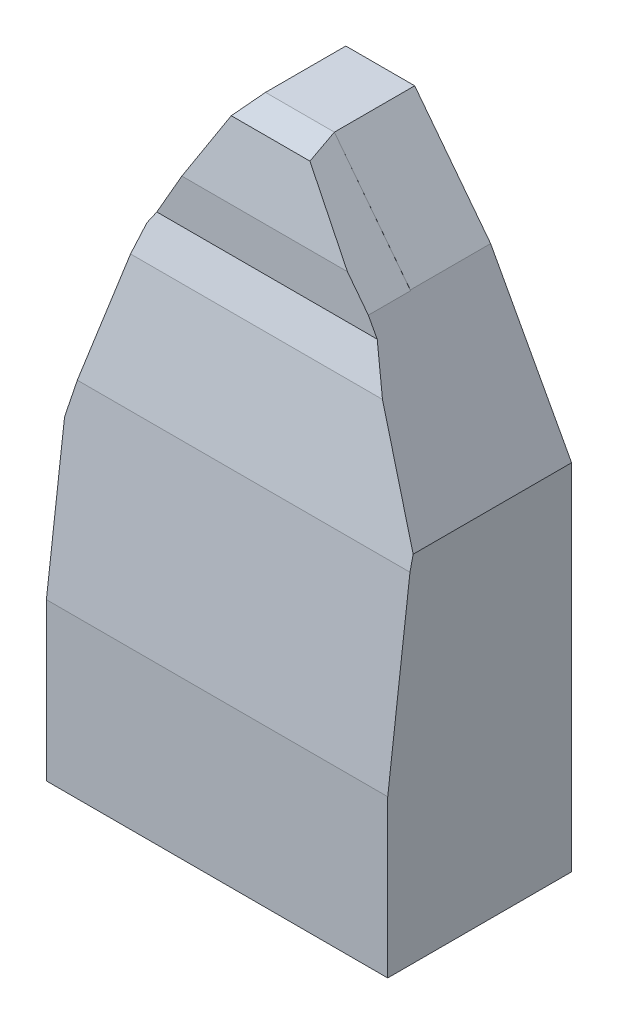
ISO-10303-21;
HEADER;
FILE_DESCRIPTION(('STEP AP214'),'2;1');
FILE_NAME('part.step','',(''),(''),'','','');
FILE_SCHEMA(('AUTOMOTIVE_DESIGN { 1 0 10303 214 1 1 1 1 }'));
ENDSEC;
DATA;
#1=APPLICATION_CONTEXT('core data for automotive mechanical design processes');
#2=APPLICATION_PROTOCOL_DEFINITION('international standard','automotive_design',2000,#1);
#3=PRODUCT_CONTEXT('',#1,'mechanical');
#4=PRODUCT('Part','Part','',(#3));
#5=PRODUCT_RELATED_PRODUCT_CATEGORY('part','',(#4));
#6=PRODUCT_DEFINITION_FORMATION('','',#4);
#7=PRODUCT_DEFINITION_CONTEXT('part definition',#1,'design');
#8=PRODUCT_DEFINITION('design','',#6,#7);
#9=PRODUCT_DEFINITION_SHAPE('','',#8);
#10=(LENGTH_UNIT() NAMED_UNIT(*) SI_UNIT(.MILLI.,.METRE.));
#11=(NAMED_UNIT(*) PLANE_ANGLE_UNIT() SI_UNIT($,.RADIAN.));
#12=(NAMED_UNIT(*) SI_UNIT($,.STERADIAN.) SOLID_ANGLE_UNIT());
#13=UNCERTAINTY_MEASURE_WITH_UNIT(LENGTH_MEASURE(1.E-05),#10,'distance_accuracy_value','');
#14=(GEOMETRIC_REPRESENTATION_CONTEXT(3) GLOBAL_UNCERTAINTY_ASSIGNED_CONTEXT((#13)) GLOBAL_UNIT_ASSIGNED_CONTEXT((#10,
#11,#12)) REPRESENTATION_CONTEXT('',''));
#15=CARTESIAN_POINT('',(0.,0.,0.));
#16=DIRECTION('',(0.,0.,1.));
#17=DIRECTION('',(1.,0.,0.));
#18=AXIS2_PLACEMENT_3D('',#15,#16,#17);
#19=CARTESIAN_POINT('',(1204.98218887024,430.506603568072,204.451845392607));
#20=DIRECTION('',(0.,0.220191711275785,0.975456616301023));
#21=DIRECTION('',(0.,-0.975456616301023,0.220191711275785));
#22=AXIS2_PLACEMENT_3D('',#19,#20,#21);
#23=PLANE('',#22);
#24=DIRECTION('',(-1.,0.,0.));
#25=VECTOR('',#24,1.);
#26=CARTESIAN_POINT('',(1204.98218887024,430.506603568072,204.451845392607));
#27=LINE('',#26,#25);
#28=CARTESIAN_POINT('',(0.,430.506603568072,204.451845392607));
#29=VERTEX_POINT('',#28);
#30=CARTESIAN_POINT('',(-420.845747540603,430.506603568072,204.451845392607));
#31=VERTEX_POINT('',#30);
#32=EDGE_CURVE('E175',#29,#31,#27,.T.);
#33=ORIENTED_EDGE('',*,*,#32,.F.);
#34=DIRECTION('',(0.,0.975456616301023,-0.220191711275785));
#35=VECTOR('',#34,1.);
#36=CARTESIAN_POINT('',(0.,430.506603568072,204.451845392607));
#37=LINE('',#36,#35);
#38=CARTESIAN_POINT('',(0.,448.235294117647,200.449913737673));
#39=VERTEX_POINT('',#38);
#40=EDGE_CURVE('E199',#29,#39,#37,.T.);
#41=ORIENTED_EDGE('',*,*,#40,.T.);
#42=DIRECTION('',(-0.467645680255062,0.862221722970269,-0.194630979489293));
#43=VECTOR('',#42,1.);
#44=CARTESIAN_POINT('',(271.033256042447,-51.4822717106138,313.252127732127));
#45=LINE('',#44,#43);
#46=CARTESIAN_POINT('',(-66.4822358849297,570.811916530486,172.780455352289));
#47=VERTEX_POINT('',#46);
#48=EDGE_CURVE('E189',#39,#47,#45,.T.);
#49=ORIENTED_EDGE('',*,*,#48,.T.);
#50=DIRECTION('',(1.,0.,0.));
#51=VECTOR('',#50,1.);
#52=CARTESIAN_POINT('',(-1204.98218887024,570.811916530486,172.780455352289));
#53=LINE('',#52,#51);
#54=CARTESIAN_POINT('',(-385.188573270177,570.811916530486,172.780455352289));
#55=VERTEX_POINT('',#54);
#56=EDGE_CURVE('E198',#55,#47,#53,.T.);
#57=ORIENTED_EDGE('',*,*,#56,.F.);
#58=DIRECTION('',(-0.240618961063724,-0.946797364835967,0.213722402934935));
#59=VECTOR('',#58,1.);
#60=CARTESIAN_POINT('',(-326.714399917151,800.89849406726,120.842566569979));
#61=LINE('',#60,#59);
#62=EDGE_CURVE('E266',#55,#31,#61,.T.);
#63=ORIENTED_EDGE('',*,*,#62,.T.);
#64=EDGE_LOOP('',(#33,#41,#49,#57,#63));
#65=FACE_BOUND('',#64,.T.);
#66=ADVANCED_FACE('F38',(#65),#23,.T.);
#67=CARTESIAN_POINT('',(1204.98218887024,198.648214009807,232.621743180966));
#68=DIRECTION('',(0.,0.120609219183544,0.992700063588159));
#69=DIRECTION('',(0.,-0.99270006358816,0.120609219183544));
#70=AXIS2_PLACEMENT_3D('',#67,#68,#69);
#71=PLANE('',#70);
#72=DIRECTION('',(-1.,0.,0.));
#73=VECTOR('',#72,1.);
#74=CARTESIAN_POINT('',(1204.98218887024,198.648214009807,232.621743180966));
#75=LINE('',#74,#73);
#76=CARTESIAN_POINT('',(0.,198.648214009807,232.621743180966));
#77=VERTEX_POINT('',#76);
#78=CARTESIAN_POINT('',(-431.8,198.648214009807,232.621743180966));
#79=VERTEX_POINT('',#78);
#80=EDGE_CURVE('E172',#77,#79,#75,.T.);
#81=ORIENTED_EDGE('',*,*,#80,.F.);
#82=DIRECTION('',(0.,0.99270006358816,-0.120609219183544));
#83=VECTOR('',#82,1.);
#84=CARTESIAN_POINT('',(0.,198.648214009807,232.621743180966));
#85=LINE('',#84,#83);
#86=EDGE_CURVE('E155',#77,#29,#85,.T.);
#87=ORIENTED_EDGE('',*,*,#86,.T.);
#88=ORIENTED_EDGE('',*,*,#32,.T.);
#89=DIRECTION('',(-0.244620012352914,-0.962540865682418,0.116944993256665));
#90=VECTOR('',#89,1.);
#91=CARTESIAN_POINT('',(-378.956393729664,595.33455240281,184.425886960886));
#92=LINE('',#91,#90);
#93=CARTESIAN_POINT('',(-431.8,387.403361344538,209.68872265246));
#94=VERTEX_POINT('',#93);
#95=EDGE_CURVE('E261',#31,#94,#92,.T.);
#96=ORIENTED_EDGE('',*,*,#95,.T.);
#97=DIRECTION('',(0.,-0.99270006358816,0.120609219183544));
#98=VECTOR('',#97,1.);
#99=CARTESIAN_POINT('',(-431.8,198.648214009807,232.621743180966));
#100=LINE('',#99,#98);
#101=EDGE_CURVE('E212',#94,#79,#100,.T.);
#102=ORIENTED_EDGE('',*,*,#101,.T.);
#103=EDGE_LOOP('',(#81,#87,#88,#96,#102));
#104=FACE_BOUND('',#103,.T.);
#105=ADVANCED_FACE('F260',(#104),#71,.T.);
#106=CARTESIAN_POINT('',(0.,0.,101.6));
#107=DIRECTION('',(0.,1.,0.));
#108=DIRECTION('',(0.,0.,1.));
#109=AXIS2_PLACEMENT_3D('',#106,#107,#108);
#110=PLANE('',#109);
#111=DIRECTION('',(0.,0.,-1.));
#112=VECTOR('',#111,1.);
#113=CARTESIAN_POINT('',(0.,0.,232.621743180966));
#114=LINE('',#113,#112);
#115=CARTESIAN_POINT('',(0.,0.,232.621743180966));
#116=VERTEX_POINT('',#115);
#117=CARTESIAN_POINT('',(0.,0.,0.));
#118=VERTEX_POINT('',#117);
#119=EDGE_CURVE('E152',#116,#118,#114,.T.);
#120=ORIENTED_EDGE('',*,*,#119,.F.);
#121=DIRECTION('',(-1.,0.,0.));
#122=VECTOR('',#121,1.);
#123=CARTESIAN_POINT('',(1204.98218887024,0.,232.621743180966));
#124=LINE('',#123,#122);
#125=CARTESIAN_POINT('',(-431.8,0.,232.621743180966));
#126=VERTEX_POINT('',#125);
#127=EDGE_CURVE('E164',#116,#126,#124,.T.);
#128=ORIENTED_EDGE('',*,*,#127,.T.);
#129=DIRECTION('',(0.,0.,-1.));
#130=VECTOR('',#129,1.);
#131=CARTESIAN_POINT('',(-431.8,0.,101.6));
#132=LINE('',#131,#130);
#133=CARTESIAN_POINT('',(-431.8,0.,0.));
#134=VERTEX_POINT('',#133);
#135=EDGE_CURVE('E173',#126,#134,#132,.T.);
#136=ORIENTED_EDGE('',*,*,#135,.T.);
#137=DIRECTION('',(1.,0.,0.));
#138=VECTOR('',#137,1.);
#139=CARTESIAN_POINT('',(0.,0.,0.));
#140=LINE('',#139,#138);
#141=EDGE_CURVE('E166',#134,#118,#140,.T.);
#142=ORIENTED_EDGE('',*,*,#141,.T.);
#143=EDGE_LOOP('',(#120,#128,#136,#142));
#144=FACE_BOUND('',#143,.T.);
#145=ADVANCED_FACE('F40',(#144),#110,.F.);
#146=CARTESIAN_POINT('',(0.,0.,0.));
#147=DIRECTION('',(0.,0.,1.));
#148=DIRECTION('',(1.,0.,0.));
#149=AXIS2_PLACEMENT_3D('',#146,#147,#148);
#150=PLANE('',#149);
#151=DIRECTION('',(0.,-1.,0.));
#152=VECTOR('',#151,1.);
#153=CARTESIAN_POINT('',(0.,0.,0.));
#154=LINE('',#153,#152);
#155=CARTESIAN_POINT('',(0.,448.235294117647,0.));
#156=VERTEX_POINT('',#155);
#157=EDGE_CURVE('E159',#156,#118,#154,.T.);
#158=ORIENTED_EDGE('',*,*,#157,.T.);
#159=ORIENTED_EDGE('',*,*,#141,.F.);
#160=DIRECTION('',(0.,1.,0.));
#161=VECTOR('',#160,1.);
#162=CARTESIAN_POINT('',(-431.8,0.,0.));
#163=LINE('',#162,#161);
#164=CARTESIAN_POINT('',(-431.8,387.403361344538,0.));
#165=VERTEX_POINT('',#164);
#166=EDGE_CURVE('E216',#134,#165,#163,.T.);
#167=ORIENTED_EDGE('',*,*,#166,.T.);
#168=DIRECTION('',(0.246310095315299,0.969191073496742,0.));
#169=VECTOR('',#168,1.);
#170=CARTESIAN_POINT('',(-431.8,387.403361344538,0.));
#171=LINE('',#170,#169);
#172=CARTESIAN_POINT('',(-377.065490395893,602.774956457665,0.));
#173=VERTEX_POINT('',#172);
#174=EDGE_CURVE('E226',#165,#173,#171,.T.);
#175=ORIENTED_EDGE('',*,*,#174,.T.);
#176=DIRECTION('',(0.497935830785845,0.867213876975922,0.));
#177=VECTOR('',#176,1.);
#178=CARTESIAN_POINT('',(-377.065490395893,602.774956457665,0.));
#179=LINE('',#178,#177);
#180=CARTESIAN_POINT('',(-285.641844576666,762.,0.));
#181=VERTEX_POINT('',#180);
#182=EDGE_CURVE('E243',#173,#181,#179,.T.);
#183=ORIENTED_EDGE('',*,*,#182,.T.);
#184=DIRECTION('',(1.,0.,0.));
#185=VECTOR('',#184,1.);
#186=CARTESIAN_POINT('',(-285.641844576666,762.,0.));
#187=LINE('',#186,#185);
#188=CARTESIAN_POINT('',(-198.504201680673,762.,0.));
#189=VERTEX_POINT('',#188);
#190=EDGE_CURVE('E240',#181,#189,#187,.T.);
#191=ORIENTED_EDGE('',*,*,#190,.T.);
#192=DIRECTION('',(0.609710760849693,-0.7926239891046,0.));
#193=VECTOR('',#192,1.);
#194=CARTESIAN_POINT('',(-198.504201680673,762.,0.));
#195=LINE('',#194,#193);
#196=CARTESIAN_POINT('',(-102.453781512605,637.134453781513,0.));
#197=VERTEX_POINT('',#196);
#198=EDGE_CURVE('E237',#189,#197,#195,.T.);
#199=ORIENTED_EDGE('',*,*,#198,.T.);
#200=DIRECTION('',(0.476763040377887,-0.879031855696728,0.));
#201=VECTOR('',#200,1.);
#202=CARTESIAN_POINT('',(-102.453781512605,637.134453781513,0.));
#203=LINE('',#202,#201);
#204=EDGE_CURVE('E234',#197,#156,#203,.T.);
#205=ORIENTED_EDGE('',*,*,#204,.T.);
#206=EDGE_LOOP('',(#158,#159,#167,#175,#183,#191,#199,#205));
#207=FACE_BOUND('',#206,.T.);
#208=ADVANCED_FACE('F296',(#207),#150,.F.);
#209=CARTESIAN_POINT('',(1204.98218887024,0.,232.621743180966));
#210=DIRECTION('',(0.,0.,1.));
#211=DIRECTION('',(1.,0.,0.));
#212=AXIS2_PLACEMENT_3D('',#209,#210,#211);
#213=PLANE('',#212);
#214=ORIENTED_EDGE('',*,*,#127,.F.);
#215=DIRECTION('',(0.,-1.,0.));
#216=VECTOR('',#215,1.);
#217=CARTESIAN_POINT('',(0.,0.,232.621743180966));
#218=LINE('',#217,#216);
#219=EDGE_CURVE('E149',#77,#116,#218,.T.);
#220=ORIENTED_EDGE('',*,*,#219,.F.);
#221=ORIENTED_EDGE('',*,*,#80,.T.);
#222=DIRECTION('',(0.,-1.,0.));
#223=VECTOR('',#222,1.);
#224=CARTESIAN_POINT('',(-431.8,0.,232.621743180966));
#225=LINE('',#224,#223);
#226=EDGE_CURVE('E171',#79,#126,#225,.T.);
#227=ORIENTED_EDGE('',*,*,#226,.T.);
#228=EDGE_LOOP('',(#214,#220,#221,#227));
#229=FACE_BOUND('',#228,.T.);
#230=ADVANCED_FACE('F169',(#229),#213,.T.);
#231=CARTESIAN_POINT('',(-1204.98218887024,752.787376515822,139.607943988774));
#232=DIRECTION('',(0.,-0.971858439473431,-0.235565646103729));
#233=DIRECTION('',(0.,0.235565646103729,-0.971858439473431));
#234=AXIS2_PLACEMENT_3D('',#231,#232,#233);
#235=PLANE('',#234);
#236=DIRECTION('',(0.134036301808538,0.233440001221541,-0.963088799450589));
#237=VECTOR('',#236,1.);
#238=CARTESIAN_POINT('',(-307.353125143363,724.187248576504,257.601701429985));
#239=LINE('',#238,#237);
#240=CARTESIAN_POINT('',(-290.93153775398,752.787376515822,139.607943988774));
#241=VERTEX_POINT('',#240);
#242=CARTESIAN_POINT('',(-285.641844576666,762.,101.6));
#243=VERTEX_POINT('',#242);
#244=EDGE_CURVE('E268',#241,#243,#239,.T.);
#245=ORIENTED_EDGE('',*,*,#244,.F.);
#246=DIRECTION('',(1.,0.,0.));
#247=VECTOR('',#246,1.);
#248=CARTESIAN_POINT('',(-1204.98218887024,752.787376515822,139.607943988774));
#249=LINE('',#248,#247);
#250=CARTESIAN_POINT('',(-191.438262559075,752.787376515822,139.607943988774));
#251=VERTEX_POINT('',#250);
#252=EDGE_CURVE('E211',#241,#251,#249,.T.);
#253=ORIENTED_EDGE('',*,*,#252,.T.);
#254=DIRECTION('',(0.178038698581419,-0.231802128357528,0.956331529908093));
#255=VECTOR('',#254,1.);
#256=CARTESIAN_POINT('',(-223.565353123708,794.616080219873,-32.96212036227));
#257=LINE('',#256,#255);
#258=CARTESIAN_POINT('',(-198.514140193442,762.,101.6));
#259=VERTEX_POINT('',#258);
#260=EDGE_CURVE('E203',#259,#251,#257,.T.);
#261=ORIENTED_EDGE('',*,*,#260,.F.);
#262=DIRECTION('',(1.,0.,0.));
#263=VECTOR('',#262,1.);
#264=CARTESIAN_POINT('',(-285.641844576666,762.,101.6));
#265=LINE('',#264,#263);
#266=EDGE_CURVE('E230',#243,#259,#265,.T.);
#267=ORIENTED_EDGE('',*,*,#266,.F.);
#268=EDGE_LOOP('',(#245,#253,#261,#267));
#269=FACE_BOUND('',#268,.T.);
#270=ADVANCED_FACE('F305',(#269),#235,.F.);
#271=CARTESIAN_POINT('',(-1204.98218887024,670.908278379318,155.089264465625));
#272=DIRECTION('',(0.,-0.185783690480533,-0.982590667751039));
#273=DIRECTION('',(0.,0.982590667751039,-0.185783690480533));
#274=AXIS2_PLACEMENT_3D('',#271,#272,#273);
#275=PLANE('',#274);
#276=DIRECTION('',(0.491374157993874,0.855785951228156,-0.16180804224862));
#277=VECTOR('',#276,1.);
#278=CARTESIAN_POINT('',(-547.289717156341,306.309423115385,224.025926596711));
#279=LINE('',#278,#277);
#280=CARTESIAN_POINT('',(-337.944780780911,670.908278379318,155.089264465625));
#281=VERTEX_POINT('',#280);
#282=EDGE_CURVE('E302',#281,#241,#279,.T.);
#283=ORIENTED_EDGE('',*,*,#282,.F.);
#284=DIRECTION('',(1.,0.,0.));
#285=VECTOR('',#284,1.);
#286=CARTESIAN_POINT('',(-1204.98218887024,670.908278379318,155.089264465625));
#287=LINE('',#286,#285);
#288=CARTESIAN_POINT('',(-128.549935447776,670.908278379318,155.089264465625));
#289=VERTEX_POINT('',#288);
#290=EDGE_CURVE('E219',#281,#289,#287,.T.);
#291=ORIENTED_EDGE('',*,*,#290,.T.);
#292=DIRECTION('',(0.602394096410472,-0.784302709301712,0.148292322093244));
#293=VECTOR('',#292,1.);
#294=CARTESIAN_POINT('',(-519.164215576894,1179.47873088331,58.9311198418813));
#295=LINE('',#294,#293);
#296=EDGE_CURVE('E200',#251,#289,#295,.T.);
#297=ORIENTED_EDGE('',*,*,#296,.F.);
#298=ORIENTED_EDGE('',*,*,#252,.F.);
#299=EDGE_LOOP('',(#283,#291,#297,#298));
#300=FACE_BOUND('',#299,.T.);
#301=ADVANCED_FACE('F308',(#300),#275,.F.);
#302=CARTESIAN_POINT('',(-1204.98218887024,615.704741572519,155.089264465625));
#303=DIRECTION('',(0.,0.,-1.));
#304=DIRECTION('',(-1.,0.,0.));
#305=AXIS2_PLACEMENT_3D('',#302,#303,#304);
#306=PLANE('',#305);
#307=DIRECTION('',(0.497935830785845,0.867213876975923,0.));
#308=VECTOR('',#307,1.);
#309=CARTESIAN_POINT('',(-576.755933198034,254.990538485215,155.089264465625));
#310=LINE('',#309,#308);
#311=CARTESIAN_POINT('',(-369.641481781665,615.704741572519,155.089264465625));
#312=VERTEX_POINT('',#311);
#313=EDGE_CURVE('E311',#312,#281,#310,.T.);
#314=ORIENTED_EDGE('',*,*,#313,.F.);
#315=DIRECTION('',(1.,0.,0.));
#316=VECTOR('',#315,1.);
#317=CARTESIAN_POINT('',(-1204.98218887024,615.704741572519,155.089264465625));
#318=LINE('',#317,#316);
#319=CARTESIAN_POINT('',(-90.8308867551851,615.704741572519,155.089264465625));
#320=VERTEX_POINT('',#319);
#321=EDGE_CURVE('E53',#312,#320,#318,.T.);
#322=ORIENTED_EDGE('',*,*,#321,.T.);
#323=DIRECTION('',(0.476763040377887,-0.879031855696728,0.));
#324=VECTOR('',#323,1.);
#325=CARTESIAN_POINT('',(-344.080816470128,1082.63429948445,155.089264465625));
#326=LINE('',#325,#324);
#327=CARTESIAN_POINT('',(-102.079559314268,636.444481603329,155.089264465625));
#328=VERTEX_POINT('',#327);
#329=EDGE_CURVE('E191',#328,#320,#326,.T.);
#330=ORIENTED_EDGE('',*,*,#329,.F.);
#331=DIRECTION('',(0.609128886515623,-0.793071244978809,0.));
#332=VECTOR('',#331,1.);
#333=CARTESIAN_POINT('',(-501.279337978843,1156.19304790722,155.089264465625));
#334=LINE('',#333,#332);
#335=EDGE_CURVE('E11',#289,#328,#334,.T.);
#336=ORIENTED_EDGE('',*,*,#335,.F.);
#337=ORIENTED_EDGE('',*,*,#290,.F.);
#338=EDGE_LOOP('',(#314,#322,#330,#336,#337));
#339=FACE_BOUND('',#338,.T.);
#340=ADVANCED_FACE('F310',(#339),#306,.F.);
#341=CARTESIAN_POINT('',(-1204.98218887024,570.811916530486,172.780455352289));
#342=DIRECTION('',(0.,-0.366634642563736,-0.930365003034917));
#343=DIRECTION('',(0.,0.930365003034917,-0.366634642563736));
#344=AXIS2_PLACEMENT_3D('',#341,#342,#343);
#345=PLANE('',#344);
#346=DIRECTION('',(0.230098455850676,0.905400849081671,-0.356796865313197));
#347=VECTOR('',#346,1.);
#348=CARTESIAN_POINT('',(-428.592791681923,400.023216282864,240.084205885628));
#349=LINE('',#348,#347);
#350=CARTESIAN_POINT('',(-377.065490395893,602.774956457665,160.184584182668));
#351=VERTEX_POINT('',#350);
#352=EDGE_CURVE('E270',#55,#351,#349,.T.);
#353=ORIENTED_EDGE('',*,*,#352,.F.);
#354=ORIENTED_EDGE('',*,*,#56,.T.);
#355=DIRECTION('',(0.450499381355594,-0.830608234374376,0.327322880941294));
#356=VECTOR('',#355,1.);
#357=CARTESIAN_POINT('',(-297.540451370432,996.825501331881,4.89866929902194));
#358=LINE('',#357,#356);
#359=EDGE_CURVE('E46',#320,#47,#358,.T.);
#360=ORIENTED_EDGE('',*,*,#359,.F.);
#361=ORIENTED_EDGE('',*,*,#321,.F.);
#362=DIRECTION('',(0.47118043852612,0.82061621113824,-0.323385263064741));
#363=VECTOR('',#362,1.);
#364=CARTESIAN_POINT('',(-575.15015238372,257.787194840225,296.13602717211));
#365=LINE('',#364,#363);
#366=EDGE_CURVE('E312',#351,#312,#365,.T.);
#367=ORIENTED_EDGE('',*,*,#366,.F.);
#368=EDGE_LOOP('',(#353,#354,#360,#361,#367));
#369=FACE_BOUND('',#368,.T.);
#370=ADVANCED_FACE('F315',(#369),#345,.F.);
#371=CARTESIAN_POINT('',(-431.8,0.,101.6));
#372=DIRECTION('',(-1.,0.,0.));
#373=DIRECTION('',(0.,0.,1.));
#374=AXIS2_PLACEMENT_3D('',#371,#372,#373);
#375=PLANE('',#374);
#376=ORIENTED_EDGE('',*,*,#101,.F.);
#377=DIRECTION('',(0.,0.,-1.));
#378=VECTOR('',#377,1.);
#379=CARTESIAN_POINT('',(-431.8,387.403361344538,101.6));
#380=LINE('',#379,#378);
#381=EDGE_CURVE('E61',#94,#165,#380,.T.);
#382=ORIENTED_EDGE('',*,*,#381,.T.);
#383=ORIENTED_EDGE('',*,*,#166,.F.);
#384=ORIENTED_EDGE('',*,*,#135,.F.);
#385=ORIENTED_EDGE('',*,*,#226,.F.);
#386=EDGE_LOOP('',(#376,#382,#383,#384,#385));
#387=FACE_BOUND('',#386,.T.);
#388=ADVANCED_FACE('F321',(#387),#375,.T.);
#389=CARTESIAN_POINT('',(-102.453781512605,637.134453781513,101.6));
#390=DIRECTION('',(0.879031855696728,0.476763040377887,0.));
#391=DIRECTION('',(-0.476763040377887,0.879031855696728,0.));
#392=AXIS2_PLACEMENT_3D('',#389,#390,#391);
#393=PLANE('',#392);
#394=ORIENTED_EDGE('',*,*,#204,.F.);
#395=DIRECTION('',(0.,0.,-1.));
#396=VECTOR('',#395,1.);
#397=CARTESIAN_POINT('',(-102.453781512605,637.134453781513,101.6));
#398=LINE('',#397,#396);
#399=CARTESIAN_POINT('',(-102.453781512605,637.134453781513,101.6));
#400=VERTEX_POINT('',#399);
#401=EDGE_CURVE('E255',#400,#197,#398,.T.);
#402=ORIENTED_EDGE('',*,*,#401,.F.);
#403=DIRECTION('',(0.476763040377887,-0.879031855696728,0.));
#404=VECTOR('',#403,1.);
#405=CARTESIAN_POINT('',(-102.453781512605,637.134453781513,101.6));
#406=LINE('',#405,#404);
#407=CARTESIAN_POINT('',(-102.079559314268,636.444481603329,101.6));
#408=VERTEX_POINT('',#407);
#409=EDGE_CURVE('E222',#400,#408,#406,.T.);
#410=ORIENTED_EDGE('',*,*,#409,.T.);
#411=DIRECTION('',(0.,0.,-1.));
#412=VECTOR('',#411,1.);
#413=CARTESIAN_POINT('',(-102.079559314268,636.444481603329,232.621743180966));
#414=LINE('',#413,#412);
#415=EDGE_CURVE('E205',#328,#408,#414,.T.);
#416=ORIENTED_EDGE('',*,*,#415,.F.);
#417=ORIENTED_EDGE('',*,*,#329,.T.);
#418=ORIENTED_EDGE('',*,*,#359,.T.);
#419=ORIENTED_EDGE('',*,*,#48,.F.);
#420=DIRECTION('',(0.,0.,-1.));
#421=VECTOR('',#420,1.);
#422=CARTESIAN_POINT('',(0.,448.235294117647,101.6));
#423=LINE('',#422,#421);
#424=EDGE_CURVE('E177',#39,#156,#423,.T.);
#425=ORIENTED_EDGE('',*,*,#424,.T.);
#426=EDGE_LOOP('',(#394,#402,#410,#416,#417,#418,#419,#425));
#427=FACE_BOUND('',#426,.T.);
#428=ADVANCED_FACE('F187',(#427),#393,.T.);
#429=CARTESIAN_POINT('',(-198.504201680673,762.,101.6));
#430=DIRECTION('',(0.7926239891046,0.609710760849693,0.));
#431=DIRECTION('',(-0.609710760849693,0.7926239891046,0.));
#432=AXIS2_PLACEMENT_3D('',#429,#430,#431);
#433=PLANE('',#432);
#434=ORIENTED_EDGE('',*,*,#198,.F.);
#435=DIRECTION('',(0.,0.,-1.));
#436=VECTOR('',#435,1.);
#437=CARTESIAN_POINT('',(-198.504201680673,762.,101.6));
#438=LINE('',#437,#436);
#439=CARTESIAN_POINT('',(-198.504201680672,762.,101.6));
#440=VERTEX_POINT('',#439);
#441=EDGE_CURVE('E253',#440,#189,#438,.T.);
#442=ORIENTED_EDGE('',*,*,#441,.F.);
#443=DIRECTION('',(0.609710760849693,-0.7926239891046,0.));
#444=VECTOR('',#443,1.);
#445=CARTESIAN_POINT('',(-198.504201680673,762.,101.6));
#446=LINE('',#445,#444);
#447=EDGE_CURVE('E225',#440,#400,#446,.T.);
#448=ORIENTED_EDGE('',*,*,#447,.T.);
#449=ORIENTED_EDGE('',*,*,#401,.T.);
#450=EDGE_LOOP('',(#434,#442,#448,#449));
#451=FACE_BOUND('',#450,.T.);
#452=ADVANCED_FACE('F294',(#451),#433,.T.);
#453=CARTESIAN_POINT('',(-285.641844576666,762.,101.6));
#454=DIRECTION('',(0.,1.,0.));
#455=DIRECTION('',(0.,0.,1.));
#456=AXIS2_PLACEMENT_3D('',#453,#454,#455);
#457=PLANE('',#456);
#458=ORIENTED_EDGE('',*,*,#190,.F.);
#459=DIRECTION('',(0.,0.,-1.));
#460=VECTOR('',#459,1.);
#461=CARTESIAN_POINT('',(-285.641844576666,762.,101.6));
#462=LINE('',#461,#460);
#463=EDGE_CURVE('E251',#243,#181,#462,.T.);
#464=ORIENTED_EDGE('',*,*,#463,.F.);
#465=ORIENTED_EDGE('',*,*,#266,.T.);
#466=EDGE_CURVE('E229',#259,#440,#265,.T.);
#467=ORIENTED_EDGE('',*,*,#466,.T.);
#468=ORIENTED_EDGE('',*,*,#441,.T.);
#469=EDGE_LOOP('',(#458,#464,#465,#467,#468));
#470=FACE_BOUND('',#469,.T.);
#471=ADVANCED_FACE('F289',(#470),#457,.T.);
#472=CARTESIAN_POINT('',(-377.065490395893,602.774956457665,101.6));
#473=DIRECTION('',(-0.867213876975923,0.497935830785845,0.));
#474=DIRECTION('',(-0.497935830785845,-0.867213876975923,0.));
#475=AXIS2_PLACEMENT_3D('',#472,#473,#474);
#476=PLANE('',#475);
#477=ORIENTED_EDGE('',*,*,#182,.F.);
#478=DIRECTION('',(0.,0.,-1.));
#479=VECTOR('',#478,1.);
#480=CARTESIAN_POINT('',(-377.065490395893,602.774956457665,101.6));
#481=LINE('',#480,#479);
#482=EDGE_CURVE('E249',#351,#173,#481,.T.);
#483=ORIENTED_EDGE('',*,*,#482,.F.);
#484=ORIENTED_EDGE('',*,*,#366,.T.);
#485=ORIENTED_EDGE('',*,*,#313,.T.);
#486=ORIENTED_EDGE('',*,*,#282,.T.);
#487=ORIENTED_EDGE('',*,*,#244,.T.);
#488=ORIENTED_EDGE('',*,*,#463,.T.);
#489=EDGE_LOOP('',(#477,#483,#484,#485,#486,#487,#488));
#490=FACE_BOUND('',#489,.T.);
#491=ADVANCED_FACE('F299',(#490),#476,.T.);
#492=CARTESIAN_POINT('',(-431.8,387.403361344538,101.6));
#493=DIRECTION('',(-0.969191073496743,0.246310095315299,0.));
#494=DIRECTION('',(-0.246310095315299,-0.969191073496743,0.));
#495=AXIS2_PLACEMENT_3D('',#492,#493,#494);
#496=PLANE('',#495);
#497=ORIENTED_EDGE('',*,*,#174,.F.);
#498=ORIENTED_EDGE('',*,*,#381,.F.);
#499=ORIENTED_EDGE('',*,*,#95,.F.);
#500=ORIENTED_EDGE('',*,*,#62,.F.);
#501=ORIENTED_EDGE('',*,*,#352,.T.);
#502=ORIENTED_EDGE('',*,*,#482,.T.);
#503=EDGE_LOOP('',(#497,#498,#499,#500,#501,#502));
#504=FACE_BOUND('',#503,.T.);
#505=ADVANCED_FACE('F264',(#504),#496,.T.);
#506=CARTESIAN_POINT('',(-102.079559314268,636.444481603329,232.621743180966));
#507=DIRECTION('',(0.793071244978809,0.609128886515623,0.));
#508=DIRECTION('',(-0.609128886515623,0.793071244978809,0.));
#509=AXIS2_PLACEMENT_3D('',#506,#507,#508);
#510=PLANE('',#509);
#511=ORIENTED_EDGE('',*,*,#260,.T.);
#512=ORIENTED_EDGE('',*,*,#296,.T.);
#513=ORIENTED_EDGE('',*,*,#335,.T.);
#514=ORIENTED_EDGE('',*,*,#415,.T.);
#515=DIRECTION('',(0.609128886515623,-0.793071244978809,0.));
#516=VECTOR('',#515,1.);
#517=CARTESIAN_POINT('',(-102.079559314268,636.444481603329,101.6));
#518=LINE('',#517,#516);
#519=EDGE_CURVE('E272',#259,#408,#518,.T.);
#520=ORIENTED_EDGE('',*,*,#519,.F.);
#521=EDGE_LOOP('',(#511,#512,#513,#514,#520));
#522=FACE_BOUND('',#521,.T.);
#523=ADVANCED_FACE('F279',(#522),#510,.T.);
#524=CARTESIAN_POINT('',(0.,0.,101.6));
#525=DIRECTION('',(0.,0.,1.));
#526=DIRECTION('',(0.,-1.,0.));
#527=AXIS2_PLACEMENT_3D('',#524,#525,#526);
#528=PLANE('',#527);
#529=ORIENTED_EDGE('',*,*,#447,.F.);
#530=ORIENTED_EDGE('',*,*,#466,.F.);
#531=ORIENTED_EDGE('',*,*,#519,.T.);
#532=ORIENTED_EDGE('',*,*,#409,.F.);
#533=EDGE_LOOP('',(#529,#530,#531,#532));
#534=FACE_BOUND('',#533,.T.);
#535=ADVANCED_FACE('F284',(#534),#528,.T.);
#536=CARTESIAN_POINT('',(0.,0.,232.621743180966));
#537=DIRECTION('',(1.,0.,0.));
#538=DIRECTION('',(0.,0.,-1.));
#539=AXIS2_PLACEMENT_3D('',#536,#537,#538);
#540=PLANE('',#539);
#541=ORIENTED_EDGE('',*,*,#86,.F.);
#542=ORIENTED_EDGE('',*,*,#219,.T.);
#543=ORIENTED_EDGE('',*,*,#119,.T.);
#544=ORIENTED_EDGE('',*,*,#157,.F.);
#545=ORIENTED_EDGE('',*,*,#424,.F.);
#546=ORIENTED_EDGE('',*,*,#40,.F.);
#547=EDGE_LOOP('',(#541,#542,#543,#544,#545,#546));
#548=FACE_BOUND('',#547,.T.);
#549=ADVANCED_FACE('F151',(#548),#540,.T.);
#550=CLOSED_SHELL('',(#66,#105,#145,#208,#230,#270,#301,#340,#370,#388,#428,#452,#471,#491,#505,
#523,#535,#549));
#551=MANIFOLD_SOLID_BREP('B2',#550);
#552=ADVANCED_BREP_SHAPE_REPRESENTATION('',(#18,#551),#14);
#553=SHAPE_DEFINITION_REPRESENTATION(#9,#552);
ENDSEC;
END-ISO-10303-21;
